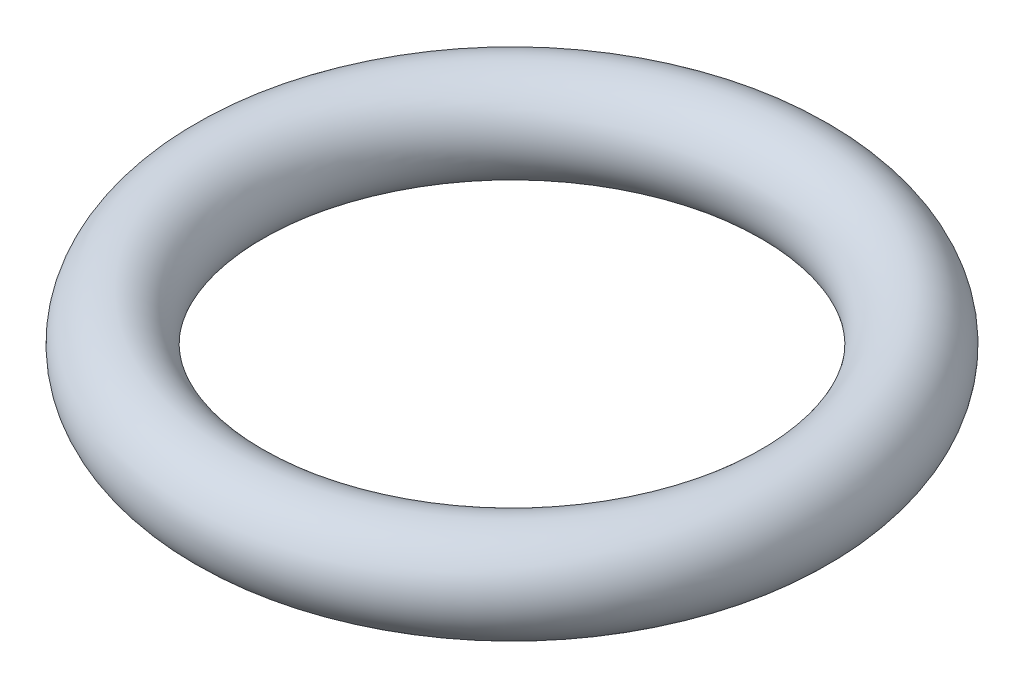
ISO-10303-21;
HEADER;
FILE_DESCRIPTION(('STEP AP214'),'2;1');
FILE_NAME('part.step','',(''),(''),'','','');
FILE_SCHEMA(('AUTOMOTIVE_DESIGN { 1 0 10303 214 1 1 1 1 }'));
ENDSEC;
DATA;
#1=APPLICATION_CONTEXT('core data for automotive mechanical design processes');
#2=APPLICATION_PROTOCOL_DEFINITION('international standard','automotive_design',2000,#1);
#3=PRODUCT_CONTEXT('',#1,'mechanical');
#4=PRODUCT('Part','Part','',(#3));
#5=PRODUCT_RELATED_PRODUCT_CATEGORY('part','',(#4));
#6=PRODUCT_DEFINITION_FORMATION('','',#4);
#7=PRODUCT_DEFINITION_CONTEXT('part definition',#1,'design');
#8=PRODUCT_DEFINITION('design','',#6,#7);
#9=PRODUCT_DEFINITION_SHAPE('','',#8);
#10=(LENGTH_UNIT() NAMED_UNIT(*) SI_UNIT(.MILLI.,.METRE.));
#11=(NAMED_UNIT(*) PLANE_ANGLE_UNIT() SI_UNIT($,.RADIAN.));
#12=(NAMED_UNIT(*) SI_UNIT($,.STERADIAN.) SOLID_ANGLE_UNIT());
#13=UNCERTAINTY_MEASURE_WITH_UNIT(LENGTH_MEASURE(1.E-05),#10,'distance_accuracy_value','');
#14=(GEOMETRIC_REPRESENTATION_CONTEXT(3) GLOBAL_UNCERTAINTY_ASSIGNED_CONTEXT((#13)) GLOBAL_UNIT_ASSIGNED_CONTEXT((#10,
#11,#12)) REPRESENTATION_CONTEXT('',''));
#15=CARTESIAN_POINT('',(0.,0.,0.));
#16=DIRECTION('',(0.,0.,1.));
#17=DIRECTION('',(1.,0.,0.));
#18=AXIS2_PLACEMENT_3D('',#15,#16,#17);
#19=CARTESIAN_POINT('',(0.,0.,0.));
#20=DIRECTION('',(0.,-1.,0.));
#21=DIRECTION('',(0.,0.,-1.));
#22=AXIS2_PLACEMENT_3D('',#19,#20,#21);
#23=TOROIDAL_SURFACE('',#22,152.4,25.4);
#24=CARTESIAN_POINT('',(0.,0.,-177.8));
#25=VERTEX_POINT('',#24);
#26=VERTEX_LOOP('',#25);
#27=FACE_BOUND('',#26,.T.);
#28=ADVANCED_FACE('F37',(#27),#23,.T.);
#29=CLOSED_SHELL('',(#28));
#30=MANIFOLD_SOLID_BREP('B2',#29);
#31=ADVANCED_BREP_SHAPE_REPRESENTATION('',(#18,#30),#14);
#32=SHAPE_DEFINITION_REPRESENTATION(#9,#31);
ENDSEC;
END-ISO-10303-21;
